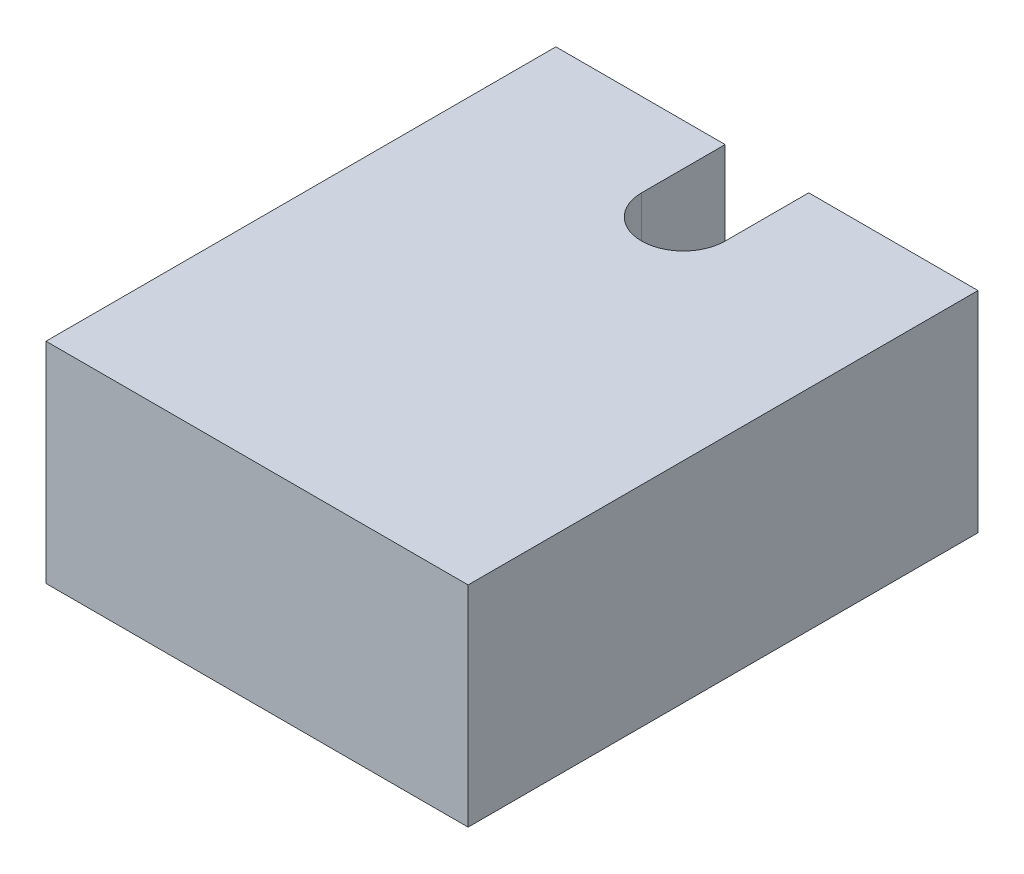
ISO-10303-21;
HEADER;
FILE_DESCRIPTION(('STEP AP214'),'2;1');
FILE_NAME('part.step','',(''),(''),'','','');
FILE_SCHEMA(('AUTOMOTIVE_DESIGN { 1 0 10303 214 1 1 1 1 }'));
ENDSEC;
DATA;
#1=APPLICATION_CONTEXT('core data for automotive mechanical design processes');
#2=APPLICATION_PROTOCOL_DEFINITION('international standard','automotive_design',2000,#1);
#3=PRODUCT_CONTEXT('',#1,'mechanical');
#4=PRODUCT('Part','Part','',(#3));
#5=PRODUCT_RELATED_PRODUCT_CATEGORY('part','',(#4));
#6=PRODUCT_DEFINITION_FORMATION('','',#4);
#7=PRODUCT_DEFINITION_CONTEXT('part definition',#1,'design');
#8=PRODUCT_DEFINITION('design','',#6,#7);
#9=PRODUCT_DEFINITION_SHAPE('','',#8);
#10=(LENGTH_UNIT() NAMED_UNIT(*) SI_UNIT(.MILLI.,.METRE.));
#11=(NAMED_UNIT(*) PLANE_ANGLE_UNIT() SI_UNIT($,.RADIAN.));
#12=(NAMED_UNIT(*) SI_UNIT($,.STERADIAN.) SOLID_ANGLE_UNIT());
#13=UNCERTAINTY_MEASURE_WITH_UNIT(LENGTH_MEASURE(1.E-05),#10,'distance_accuracy_value','');
#14=(GEOMETRIC_REPRESENTATION_CONTEXT(3) GLOBAL_UNCERTAINTY_ASSIGNED_CONTEXT((#13)) GLOBAL_UNIT_ASSIGNED_CONTEXT((#10,
#11,#12)) REPRESENTATION_CONTEXT('',''));
#15=CARTESIAN_POINT('',(0.,0.,0.));
#16=DIRECTION('',(0.,0.,1.));
#17=DIRECTION('',(1.,0.,0.));
#18=AXIS2_PLACEMENT_3D('',#15,#16,#17);
#19=CARTESIAN_POINT('',(2.025,2.51,-6.1));
#20=DIRECTION('',(-1.,0.,0.));
#21=DIRECTION('',(0.,0.,1.));
#22=AXIS2_PLACEMENT_3D('',#19,#20,#21);
#23=PLANE('',#22);
#24=DIRECTION('',(0.,0.,-1.));
#25=VECTOR('',#24,1.);
#26=CARTESIAN_POINT('',(2.025,0.,-6.1));
#27=LINE('',#26,#25);
#28=CARTESIAN_POINT('',(2.025,0.,-5.1));
#29=VERTEX_POINT('',#28);
#30=CARTESIAN_POINT('',(2.025,0.,-6.1));
#31=VERTEX_POINT('',#30);
#32=EDGE_CURVE('E93',#29,#31,#27,.T.);
#33=ORIENTED_EDGE('',*,*,#32,.T.);
#34=DIRECTION('',(0.,-1.,0.));
#35=VECTOR('',#34,1.);
#36=CARTESIAN_POINT('',(2.025,2.51,-6.1));
#37=LINE('',#36,#35);
#38=CARTESIAN_POINT('',(2.025,2.51,-6.1));
#39=VERTEX_POINT('',#38);
#40=EDGE_CURVE('E111',#39,#31,#37,.T.);
#41=ORIENTED_EDGE('',*,*,#40,.F.);
#42=DIRECTION('',(0.,0.,-1.));
#43=VECTOR('',#42,1.);
#44=CARTESIAN_POINT('',(2.025,2.51,-6.1));
#45=LINE('',#44,#43);
#46=CARTESIAN_POINT('',(2.025,2.51,-5.1));
#47=VERTEX_POINT('',#46);
#48=EDGE_CURVE('E108',#47,#39,#45,.T.);
#49=ORIENTED_EDGE('',*,*,#48,.F.);
#50=DIRECTION('',(0.,-1.,0.));
#51=VECTOR('',#50,1.);
#52=CARTESIAN_POINT('',(2.025,2.51,-5.1));
#53=LINE('',#52,#51);
#54=EDGE_CURVE('E106',#47,#29,#53,.T.);
#55=ORIENTED_EDGE('',*,*,#54,.T.);
#56=EDGE_LOOP('',(#33,#41,#49,#55));
#57=FACE_BOUND('',#56,.T.);
#58=CARTESIAN_POINT('',(2.025,1.255,-5.6));
#59=DIRECTION('',(-1.,0.,0.));
#60=DIRECTION('',(0.,0.,1.));
#61=AXIS2_PLACEMENT_3D('',#58,#59,#60);
#62=CIRCLE('',#61,0.25);
#63=CARTESIAN_POINT('',(2.025,1.255,-5.35));
#64=VERTEX_POINT('',#63);
#65=EDGE_CURVE('E11',#64,#64,#62,.F.);
#66=ORIENTED_EDGE('',*,*,#65,.F.);
#67=EDGE_LOOP('',(#66));
#68=FACE_BOUND('',#67,.T.);
#69=ADVANCED_FACE('F28',(#57,#68),#23,.F.);
#70=CARTESIAN_POINT('',(3.025,2.51,-5.1));
#71=DIRECTION('',(1.,0.,0.));
#72=DIRECTION('',(0.,0.,-1.));
#73=AXIS2_PLACEMENT_3D('',#70,#71,#72);
#74=PLANE('',#73);
#75=DIRECTION('',(0.,0.,1.));
#76=VECTOR('',#75,1.);
#77=CARTESIAN_POINT('',(3.025,0.,-5.1));
#78=LINE('',#77,#76);
#79=CARTESIAN_POINT('',(3.025,0.,-6.1));
#80=VERTEX_POINT('',#79);
#81=CARTESIAN_POINT('',(3.025,0.,-5.1));
#82=VERTEX_POINT('',#81);
#83=EDGE_CURVE('E126',#80,#82,#78,.T.);
#84=ORIENTED_EDGE('',*,*,#83,.T.);
#85=DIRECTION('',(0.,-1.,0.));
#86=VECTOR('',#85,1.);
#87=CARTESIAN_POINT('',(3.025,2.51,-5.1));
#88=LINE('',#87,#86);
#89=CARTESIAN_POINT('',(3.025,2.51,-5.1));
#90=VERTEX_POINT('',#89);
#91=EDGE_CURVE('E114',#90,#82,#88,.T.);
#92=ORIENTED_EDGE('',*,*,#91,.F.);
#93=DIRECTION('',(0.,0.,1.));
#94=VECTOR('',#93,1.);
#95=CARTESIAN_POINT('',(3.025,2.51,-5.1));
#96=LINE('',#95,#94);
#97=CARTESIAN_POINT('',(3.025,2.51,-6.1));
#98=VERTEX_POINT('',#97);
#99=EDGE_CURVE('E43',#98,#90,#96,.T.);
#100=ORIENTED_EDGE('',*,*,#99,.F.);
#101=DIRECTION('',(0.,-1.,0.));
#102=VECTOR('',#101,1.);
#103=CARTESIAN_POINT('',(3.025,2.51,-6.1));
#104=LINE('',#103,#102);
#105=EDGE_CURVE('E142',#98,#80,#104,.T.);
#106=ORIENTED_EDGE('',*,*,#105,.T.);
#107=EDGE_LOOP('',(#84,#92,#100,#106));
#108=FACE_BOUND('',#107,.T.);
#109=CARTESIAN_POINT('',(3.025,1.255,-5.6));
#110=DIRECTION('',(1.,0.,0.));
#111=DIRECTION('',(0.,0.,-1.));
#112=AXIS2_PLACEMENT_3D('',#109,#110,#111);
#113=CIRCLE('',#112,0.25);
#114=CARTESIAN_POINT('',(3.025,1.255,-5.85));
#115=VERTEX_POINT('',#114);
#116=EDGE_CURVE('E36',#115,#115,#113,.F.);
#117=ORIENTED_EDGE('',*,*,#116,.F.);
#118=EDGE_LOOP('',(#117));
#119=FACE_BOUND('',#118,.T.);
#120=ADVANCED_FACE('F163',(#108,#119),#74,.F.);
#121=CARTESIAN_POINT('',(2.525,2.51,-5.1));
#122=DIRECTION('',(0.,-1.,0.));
#123=DIRECTION('',(0.,0.,-1.));
#124=AXIS2_PLACEMENT_3D('',#121,#122,#123);
#125=CYLINDRICAL_SURFACE('',#124,0.5);
#126=CARTESIAN_POINT('',(2.525,0.,-5.1));
#127=DIRECTION('',(0.,-1.,0.));
#128=DIRECTION('',(0.,0.,1.));
#129=AXIS2_PLACEMENT_3D('',#126,#127,#128);
#130=CIRCLE('',#129,0.5);
#131=EDGE_CURVE('E98',#82,#29,#130,.T.);
#132=ORIENTED_EDGE('',*,*,#131,.T.);
#133=ORIENTED_EDGE('',*,*,#54,.F.);
#134=CARTESIAN_POINT('',(2.525,2.51,-5.1));
#135=DIRECTION('',(0.,-1.,0.));
#136=DIRECTION('',(0.,0.,1.));
#137=AXIS2_PLACEMENT_3D('',#134,#135,#136);
#138=CIRCLE('',#137,0.5);
#139=EDGE_CURVE('E128',#90,#47,#138,.T.);
#140=ORIENTED_EDGE('',*,*,#139,.F.);
#141=ORIENTED_EDGE('',*,*,#91,.T.);
#142=EDGE_LOOP('',(#132,#133,#140,#141));
#143=FACE_BOUND('',#142,.T.);
#144=ADVANCED_FACE('F30',(#143),#125,.F.);
#145=CARTESIAN_POINT('',(0.,2.51,-6.1));
#146=DIRECTION('',(0.,0.,1.));
#147=DIRECTION('',(1.,0.,0.));
#148=AXIS2_PLACEMENT_3D('',#145,#146,#147);
#149=PLANE('',#148);
#150=DIRECTION('',(-1.,0.,0.));
#151=VECTOR('',#150,1.);
#152=CARTESIAN_POINT('',(0.,0.,-6.1));
#153=LINE('',#152,#151);
#154=CARTESIAN_POINT('',(0.,0.,-6.1));
#155=VERTEX_POINT('',#154);
#156=EDGE_CURVE('E100',#31,#155,#153,.T.);
#157=ORIENTED_EDGE('',*,*,#156,.T.);
#158=DIRECTION('',(0.,-1.,0.));
#159=VECTOR('',#158,1.);
#160=CARTESIAN_POINT('',(0.,2.51,-6.1));
#161=LINE('',#160,#159);
#162=CARTESIAN_POINT('',(0.,2.51,-6.1));
#163=VERTEX_POINT('',#162);
#164=EDGE_CURVE('E154',#163,#155,#161,.T.);
#165=ORIENTED_EDGE('',*,*,#164,.F.);
#166=DIRECTION('',(-1.,0.,0.));
#167=VECTOR('',#166,1.);
#168=CARTESIAN_POINT('',(0.,2.51,-6.1));
#169=LINE('',#168,#167);
#170=EDGE_CURVE('E131',#39,#163,#169,.T.);
#171=ORIENTED_EDGE('',*,*,#170,.F.);
#172=ORIENTED_EDGE('',*,*,#40,.T.);
#173=EDGE_LOOP('',(#157,#165,#171,#172));
#174=FACE_BOUND('',#173,.T.);
#175=ADVANCED_FACE('F172',(#174),#149,.F.);
#176=CARTESIAN_POINT('',(0.,2.51,0.));
#177=DIRECTION('',(1.,0.,0.));
#178=DIRECTION('',(0.,0.,-1.));
#179=AXIS2_PLACEMENT_3D('',#176,#177,#178);
#180=PLANE('',#179);
#181=DIRECTION('',(0.,0.,1.));
#182=VECTOR('',#181,1.);
#183=CARTESIAN_POINT('',(0.,0.,0.));
#184=LINE('',#183,#182);
#185=CARTESIAN_POINT('',(0.,0.,0.));
#186=VERTEX_POINT('',#185);
#187=EDGE_CURVE('E118',#155,#186,#184,.T.);
#188=ORIENTED_EDGE('',*,*,#187,.T.);
#189=DIRECTION('',(0.,-1.,0.));
#190=VECTOR('',#189,1.);
#191=CARTESIAN_POINT('',(0.,2.51,0.));
#192=LINE('',#191,#190);
#193=CARTESIAN_POINT('',(0.,2.51,0.));
#194=VERTEX_POINT('',#193);
#195=EDGE_CURVE('E151',#194,#186,#192,.T.);
#196=ORIENTED_EDGE('',*,*,#195,.F.);
#197=DIRECTION('',(0.,0.,1.));
#198=VECTOR('',#197,1.);
#199=CARTESIAN_POINT('',(0.,2.51,0.));
#200=LINE('',#199,#198);
#201=EDGE_CURVE('E133',#163,#194,#200,.T.);
#202=ORIENTED_EDGE('',*,*,#201,.F.);
#203=ORIENTED_EDGE('',*,*,#164,.T.);
#204=EDGE_LOOP('',(#188,#196,#202,#203));
#205=FACE_BOUND('',#204,.T.);
#206=ADVANCED_FACE('F188',(#205),#180,.F.);
#207=CARTESIAN_POINT('',(5.05,2.51,0.));
#208=DIRECTION('',(0.,0.,-1.));
#209=DIRECTION('',(-1.,0.,0.));
#210=AXIS2_PLACEMENT_3D('',#207,#208,#209);
#211=PLANE('',#210);
#212=DIRECTION('',(1.,0.,0.));
#213=VECTOR('',#212,1.);
#214=CARTESIAN_POINT('',(5.05,0.,0.));
#215=LINE('',#214,#213);
#216=CARTESIAN_POINT('',(5.05,0.,0.));
#217=VERTEX_POINT('',#216);
#218=EDGE_CURVE('E120',#186,#217,#215,.T.);
#219=ORIENTED_EDGE('',*,*,#218,.T.);
#220=DIRECTION('',(0.,-1.,0.));
#221=VECTOR('',#220,1.);
#222=CARTESIAN_POINT('',(5.05,2.51,0.));
#223=LINE('',#222,#221);
#224=CARTESIAN_POINT('',(5.05,2.51,0.));
#225=VERTEX_POINT('',#224);
#226=EDGE_CURVE('E148',#225,#217,#223,.T.);
#227=ORIENTED_EDGE('',*,*,#226,.F.);
#228=DIRECTION('',(1.,0.,0.));
#229=VECTOR('',#228,1.);
#230=CARTESIAN_POINT('',(5.05,2.51,0.));
#231=LINE('',#230,#229);
#232=EDGE_CURVE('E135',#194,#225,#231,.T.);
#233=ORIENTED_EDGE('',*,*,#232,.F.);
#234=ORIENTED_EDGE('',*,*,#195,.T.);
#235=EDGE_LOOP('',(#219,#227,#233,#234));
#236=FACE_BOUND('',#235,.T.);
#237=ADVANCED_FACE('F184',(#236),#211,.F.);
#238=CARTESIAN_POINT('',(5.05,2.51,-6.1));
#239=DIRECTION('',(-1.,0.,0.));
#240=DIRECTION('',(0.,0.,1.));
#241=AXIS2_PLACEMENT_3D('',#238,#239,#240);
#242=PLANE('',#241);
#243=DIRECTION('',(0.,0.,-1.));
#244=VECTOR('',#243,1.);
#245=CARTESIAN_POINT('',(5.05,0.,-6.1));
#246=LINE('',#245,#244);
#247=CARTESIAN_POINT('',(5.05,0.,-6.1));
#248=VERTEX_POINT('',#247);
#249=EDGE_CURVE('E122',#217,#248,#246,.T.);
#250=ORIENTED_EDGE('',*,*,#249,.T.);
#251=DIRECTION('',(0.,-1.,0.));
#252=VECTOR('',#251,1.);
#253=CARTESIAN_POINT('',(5.05,2.51,-6.1));
#254=LINE('',#253,#252);
#255=CARTESIAN_POINT('',(5.05,2.51,-6.1));
#256=VERTEX_POINT('',#255);
#257=EDGE_CURVE('E145',#256,#248,#254,.T.);
#258=ORIENTED_EDGE('',*,*,#257,.F.);
#259=DIRECTION('',(0.,0.,-1.));
#260=VECTOR('',#259,1.);
#261=CARTESIAN_POINT('',(5.05,2.51,-6.1));
#262=LINE('',#261,#260);
#263=EDGE_CURVE('E137',#225,#256,#262,.T.);
#264=ORIENTED_EDGE('',*,*,#263,.F.);
#265=ORIENTED_EDGE('',*,*,#226,.T.);
#266=EDGE_LOOP('',(#250,#258,#264,#265));
#267=FACE_BOUND('',#266,.T.);
#268=ADVANCED_FACE('F180',(#267),#242,.F.);
#269=CARTESIAN_POINT('',(3.025,2.51,-6.1));
#270=DIRECTION('',(0.,0.,1.));
#271=DIRECTION('',(1.,0.,0.));
#272=AXIS2_PLACEMENT_3D('',#269,#270,#271);
#273=PLANE('',#272);
#274=DIRECTION('',(-1.,0.,0.));
#275=VECTOR('',#274,1.);
#276=CARTESIAN_POINT('',(3.025,0.,-6.1));
#277=LINE('',#276,#275);
#278=EDGE_CURVE('E124',#248,#80,#277,.T.);
#279=ORIENTED_EDGE('',*,*,#278,.T.);
#280=ORIENTED_EDGE('',*,*,#105,.F.);
#281=DIRECTION('',(-1.,0.,0.));
#282=VECTOR('',#281,1.);
#283=CARTESIAN_POINT('',(3.025,2.51,-6.1));
#284=LINE('',#283,#282);
#285=EDGE_CURVE('E48',#256,#98,#284,.T.);
#286=ORIENTED_EDGE('',*,*,#285,.F.);
#287=ORIENTED_EDGE('',*,*,#257,.T.);
#288=EDGE_LOOP('',(#279,#280,#286,#287));
#289=FACE_BOUND('',#288,.T.);
#290=ADVANCED_FACE('F177',(#289),#273,.F.);
#291=CARTESIAN_POINT('',(2.525,2.51,-5.1));
#292=DIRECTION('',(0.,1.,0.));
#293=DIRECTION('',(0.,0.,1.));
#294=AXIS2_PLACEMENT_3D('',#291,#292,#293);
#295=PLANE('',#294);
#296=ORIENTED_EDGE('',*,*,#139,.T.);
#297=ORIENTED_EDGE('',*,*,#48,.T.);
#298=ORIENTED_EDGE('',*,*,#170,.T.);
#299=ORIENTED_EDGE('',*,*,#201,.T.);
#300=ORIENTED_EDGE('',*,*,#232,.T.);
#301=ORIENTED_EDGE('',*,*,#263,.T.);
#302=ORIENTED_EDGE('',*,*,#285,.T.);
#303=ORIENTED_EDGE('',*,*,#99,.T.);
#304=EDGE_LOOP('',(#296,#297,#298,#299,#300,#301,#302,#303));
#305=FACE_BOUND('',#304,.T.);
#306=ADVANCED_FACE('F175',(#305),#295,.T.);
#307=CARTESIAN_POINT('',(2.525,0.,-5.1));
#308=DIRECTION('',(0.,1.,0.));
#309=DIRECTION('',(0.,0.,1.));
#310=AXIS2_PLACEMENT_3D('',#307,#308,#309);
#311=PLANE('',#310);
#312=ORIENTED_EDGE('',*,*,#131,.F.);
#313=ORIENTED_EDGE('',*,*,#83,.F.);
#314=ORIENTED_EDGE('',*,*,#278,.F.);
#315=ORIENTED_EDGE('',*,*,#249,.F.);
#316=ORIENTED_EDGE('',*,*,#218,.F.);
#317=ORIENTED_EDGE('',*,*,#187,.F.);
#318=ORIENTED_EDGE('',*,*,#156,.F.);
#319=ORIENTED_EDGE('',*,*,#32,.F.);
#320=EDGE_LOOP('',(#312,#313,#314,#315,#316,#317,#318,#319));
#321=FACE_BOUND('',#320,.T.);
#322=ADVANCED_FACE('F95',(#321),#311,.F.);
#323=CARTESIAN_POINT('',(3.025,1.255,-5.6));
#324=DIRECTION('',(-1.,0.,0.));
#325=DIRECTION('',(0.,0.,1.));
#326=AXIS2_PLACEMENT_3D('',#323,#324,#325);
#327=CYLINDRICAL_SURFACE('',#326,0.25);
#328=ORIENTED_EDGE('',*,*,#116,.T.);
#329=EDGE_LOOP('',(#328));
#330=FACE_BOUND('',#329,.T.);
#331=ORIENTED_EDGE('',*,*,#65,.T.);
#332=EDGE_LOOP('',(#331));
#333=FACE_BOUND('',#332,.T.);
#334=ADVANCED_FACE('F160',(#330,#333),#327,.T.);
#335=CLOSED_SHELL('',(#69,#120,#144,#175,#206,#237,#268,#290,#306,#322,#334));
#336=MANIFOLD_SOLID_BREP('B2',#335);
#337=ADVANCED_BREP_SHAPE_REPRESENTATION('',(#18,#336),#14);
#338=SHAPE_DEFINITION_REPRESENTATION(#9,#337);
ENDSEC;
END-ISO-10303-21;
